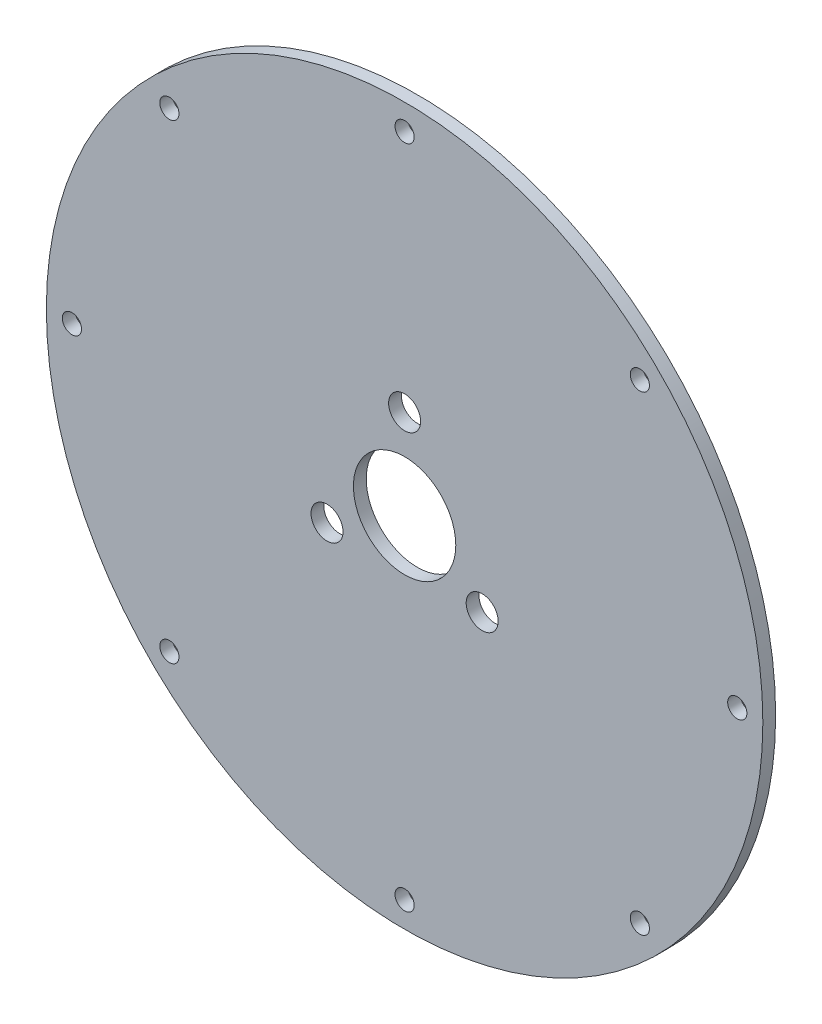
ISO-10303-21;
HEADER;
FILE_DESCRIPTION(('STEP AP214'),'2;1');
FILE_NAME('part.step','',(''),(''),'','','');
FILE_SCHEMA(('AUTOMOTIVE_DESIGN { 1 0 10303 214 1 1 1 1 }'));
ENDSEC;
DATA;
#1=APPLICATION_CONTEXT('core data for automotive mechanical design processes');
#2=APPLICATION_PROTOCOL_DEFINITION('international standard','automotive_design',2000,#1);
#3=PRODUCT_CONTEXT('',#1,'mechanical');
#4=PRODUCT('Part','Part','',(#3));
#5=PRODUCT_RELATED_PRODUCT_CATEGORY('part','',(#4));
#6=PRODUCT_DEFINITION_FORMATION('','',#4);
#7=PRODUCT_DEFINITION_CONTEXT('part definition',#1,'design');
#8=PRODUCT_DEFINITION('design','',#6,#7);
#9=PRODUCT_DEFINITION_SHAPE('','',#8);
#10=(LENGTH_UNIT() NAMED_UNIT(*) SI_UNIT(.MILLI.,.METRE.));
#11=(NAMED_UNIT(*) PLANE_ANGLE_UNIT() SI_UNIT($,.RADIAN.));
#12=(NAMED_UNIT(*) SI_UNIT($,.STERADIAN.) SOLID_ANGLE_UNIT());
#13=UNCERTAINTY_MEASURE_WITH_UNIT(LENGTH_MEASURE(1.E-05),#10,'distance_accuracy_value','');
#14=(GEOMETRIC_REPRESENTATION_CONTEXT(3) GLOBAL_UNCERTAINTY_ASSIGNED_CONTEXT((#13)) GLOBAL_UNIT_ASSIGNED_CONTEXT((#10,
#11,#12)) REPRESENTATION_CONTEXT('',''));
#15=CARTESIAN_POINT('',(0.,0.,0.));
#16=DIRECTION('',(0.,0.,1.));
#17=DIRECTION('',(1.,0.,0.));
#18=AXIS2_PLACEMENT_3D('',#15,#16,#17);
#19=CARTESIAN_POINT('',(0.,0.,3.175));
#20=DIRECTION('',(0.,0.,1.));
#21=DIRECTION('',(1.,0.,0.));
#22=AXIS2_PLACEMENT_3D('',#19,#20,#21);
#23=PLANE('',#22);
#24=CARTESIAN_POINT('',(-82.5499999999932,-6.75975422558164E-12,3.175));
#25=DIRECTION('',(0.,0.,1.));
#26=DIRECTION('',(1.,0.,0.));
#27=AXIS2_PLACEMENT_3D('',#24,#25,#26);
#28=CIRCLE('',#27,2.38125000000001);
#29=CARTESIAN_POINT('',(-80.1687499999933,-6.75975422558164E-12,3.175));
#30=VERTEX_POINT('',#29);
#31=EDGE_CURVE('E130',#30,#30,#28,.T.);
#32=ORIENTED_EDGE('',*,*,#31,.F.);
#33=EDGE_LOOP('',(#32));
#34=FACE_BOUND('',#33,.T.);
#35=CARTESIAN_POINT('',(1.34992895325094E-11,-82.55,3.175));
#36=DIRECTION('',(0.,0.,1.));
#37=DIRECTION('',(1.,0.,0.));
#38=AXIS2_PLACEMENT_3D('',#35,#36,#37);
#39=CIRCLE('',#38,2.38125);
#40=CARTESIAN_POINT('',(2.3812500000135,-82.55,3.175));
#41=VERTEX_POINT('',#40);
#42=EDGE_CURVE('E114',#41,#41,#39,.T.);
#43=ORIENTED_EDGE('',*,*,#42,.F.);
#44=EDGE_LOOP('',(#43));
#45=FACE_BOUND('',#44,.T.);
#46=CARTESIAN_POINT('',(82.5500000000067,6.74964476625468E-12,3.175));
#47=DIRECTION('',(0.,0.,1.));
#48=DIRECTION('',(1.,0.,0.));
#49=AXIS2_PLACEMENT_3D('',#46,#47,#48);
#50=CIRCLE('',#49,2.38125000000001);
#51=CARTESIAN_POINT('',(84.9312500000067,6.74964476625468E-12,3.175));
#52=VERTEX_POINT('',#51);
#53=EDGE_CURVE('E98',#52,#52,#50,.T.);
#54=ORIENTED_EDGE('',*,*,#53,.F.);
#55=EDGE_LOOP('',(#54));
#56=FACE_BOUND('',#55,.T.);
#57=CARTESIAN_POINT('',(0.,0.,3.175));
#58=DIRECTION('',(0.,0.,1.));
#59=DIRECTION('',(1.,0.,0.));
#60=AXIS2_PLACEMENT_3D('',#57,#58,#59);
#61=CIRCLE('',#60,12.7);
#62=CARTESIAN_POINT('',(12.7,0.,3.175));
#63=VERTEX_POINT('',#62);
#64=EDGE_CURVE('E82',#63,#63,#61,.T.);
#65=ORIENTED_EDGE('',*,*,#64,.F.);
#66=EDGE_LOOP('',(#65));
#67=FACE_BOUND('',#66,.T.);
#68=CARTESIAN_POINT('',(-19.2474145991092,-11.1124999999998,3.175));
#69=DIRECTION('',(0.,0.,1.));
#70=DIRECTION('',(1.,0.,0.));
#71=AXIS2_PLACEMENT_3D('',#68,#69,#70);
#72=CIRCLE('',#71,3.96875);
#73=CARTESIAN_POINT('',(-15.2786645991092,-11.1124999999998,3.175));
#74=VERTEX_POINT('',#73);
#75=EDGE_CURVE('E66',#74,#74,#72,.T.);
#76=ORIENTED_EDGE('',*,*,#75,.F.);
#77=EDGE_LOOP('',(#76));
#78=FACE_BOUND('',#77,.T.);
#79=CARTESIAN_POINT('',(0.,22.225,3.175));
#80=DIRECTION('',(0.,0.,1.));
#81=DIRECTION('',(1.,0.,0.));
#82=AXIS2_PLACEMENT_3D('',#79,#80,#81);
#83=CIRCLE('',#82,3.96875);
#84=CARTESIAN_POINT('',(3.96875,22.225,3.175));
#85=VERTEX_POINT('',#84);
#86=EDGE_CURVE('E52',#85,#85,#83,.T.);
#87=ORIENTED_EDGE('',*,*,#86,.F.);
#88=EDGE_LOOP('',(#87));
#89=FACE_BOUND('',#88,.T.);
#90=CARTESIAN_POINT('',(0.,0.,3.175));
#91=DIRECTION('',(0.,0.,1.));
#92=DIRECTION('',(1.,0.,0.));
#93=AXIS2_PLACEMENT_3D('',#90,#91,#92);
#94=CIRCLE('',#93,88.9);
#95=CARTESIAN_POINT('',(88.9,0.,3.175));
#96=VERTEX_POINT('',#95);
#97=EDGE_CURVE('E10',#96,#96,#94,.T.);
#98=ORIENTED_EDGE('',*,*,#97,.T.);
#99=EDGE_LOOP('',(#98));
#100=FACE_BOUND('',#99,.T.);
#101=CARTESIAN_POINT('',(19.2474145991091,-11.1125000000001,3.175));
#102=DIRECTION('',(0.,0.,1.));
#103=DIRECTION('',(1.,0.,0.));
#104=AXIS2_PLACEMENT_3D('',#101,#102,#103);
#105=CIRCLE('',#104,3.96875);
#106=CARTESIAN_POINT('',(23.2161645991091,-11.1125000000001,3.175));
#107=VERTEX_POINT('',#106);
#108=EDGE_CURVE('E58',#107,#107,#105,.T.);
#109=ORIENTED_EDGE('',*,*,#108,.F.);
#110=EDGE_LOOP('',(#109));
#111=FACE_BOUND('',#110,.T.);
#112=CARTESIAN_POINT('',(0.,82.55,3.175));
#113=DIRECTION('',(0.,0.,1.));
#114=DIRECTION('',(1.,0.,0.));
#115=AXIS2_PLACEMENT_3D('',#112,#113,#114);
#116=CIRCLE('',#115,2.38125);
#117=CARTESIAN_POINT('',(2.38125,82.55,3.175));
#118=VERTEX_POINT('',#117);
#119=EDGE_CURVE('E74',#118,#118,#116,.T.);
#120=ORIENTED_EDGE('',*,*,#119,.F.);
#121=EDGE_LOOP('',(#120));
#122=FACE_BOUND('',#121,.T.);
#123=CARTESIAN_POINT('',(58.3716647869515,58.3716647869543,3.175));
#124=DIRECTION('',(0.,0.,1.));
#125=DIRECTION('',(1.,0.,0.));
#126=AXIS2_PLACEMENT_3D('',#123,#124,#125);
#127=CIRCLE('',#126,2.38125);
#128=CARTESIAN_POINT('',(60.7529147869515,58.3716647869543,3.175));
#129=VERTEX_POINT('',#128);
#130=EDGE_CURVE('E90',#129,#129,#127,.T.);
#131=ORIENTED_EDGE('',*,*,#130,.F.);
#132=EDGE_LOOP('',(#131));
#133=FACE_BOUND('',#132,.T.);
#134=CARTESIAN_POINT('',(58.371664786961,-58.3716647869447,3.175));
#135=DIRECTION('',(0.,0.,1.));
#136=DIRECTION('',(1.,0.,0.));
#137=AXIS2_PLACEMENT_3D('',#134,#135,#136);
#138=CIRCLE('',#137,2.38125);
#139=CARTESIAN_POINT('',(60.752914786961,-58.3716647869447,3.175));
#140=VERTEX_POINT('',#139);
#141=EDGE_CURVE('E106',#140,#140,#138,.T.);
#142=ORIENTED_EDGE('',*,*,#141,.F.);
#143=EDGE_LOOP('',(#142));
#144=FACE_BOUND('',#143,.T.);
#145=CARTESIAN_POINT('',(-58.371664786938,-58.3716647869543,3.175));
#146=DIRECTION('',(0.,0.,1.));
#147=DIRECTION('',(1.,0.,0.));
#148=AXIS2_PLACEMENT_3D('',#145,#146,#147);
#149=CIRCLE('',#148,2.38125);
#150=CARTESIAN_POINT('',(-55.990414786938,-58.3716647869543,3.175));
#151=VERTEX_POINT('',#150);
#152=EDGE_CURVE('E122',#151,#151,#149,.T.);
#153=ORIENTED_EDGE('',*,*,#152,.F.);
#154=EDGE_LOOP('',(#153));
#155=FACE_BOUND('',#154,.T.);
#156=CARTESIAN_POINT('',(-58.3716647869475,58.3716647869447,3.175));
#157=DIRECTION('',(0.,0.,1.));
#158=DIRECTION('',(1.,0.,0.));
#159=AXIS2_PLACEMENT_3D('',#156,#157,#158);
#160=CIRCLE('',#159,2.38125);
#161=CARTESIAN_POINT('',(-55.9904147869475,58.3716647869447,3.175));
#162=VERTEX_POINT('',#161);
#163=EDGE_CURVE('E138',#162,#162,#160,.T.);
#164=ORIENTED_EDGE('',*,*,#163,.F.);
#165=EDGE_LOOP('',(#164));
#166=FACE_BOUND('',#165,.T.);
#167=ADVANCED_FACE('F39',(#34,#45,#56,#67,#78,#89,#100,#111,#122,#133,#144,#155,#166),#23,.T.);
#168=CARTESIAN_POINT('',(0.,0.,0.));
#169=DIRECTION('',(0.,0.,1.));
#170=DIRECTION('',(1.,0.,0.));
#171=AXIS2_PLACEMENT_3D('',#168,#169,#170);
#172=PLANE('',#171);
#173=CARTESIAN_POINT('',(0.,0.,0.));
#174=DIRECTION('',(0.,0.,1.));
#175=DIRECTION('',(1.,0.,0.));
#176=AXIS2_PLACEMENT_3D('',#173,#174,#175);
#177=CIRCLE('',#176,88.9);
#178=CARTESIAN_POINT('',(88.9,0.,0.));
#179=VERTEX_POINT('',#178);
#180=EDGE_CURVE('E43',#179,#179,#177,.T.);
#181=ORIENTED_EDGE('',*,*,#180,.F.);
#182=EDGE_LOOP('',(#181));
#183=FACE_BOUND('',#182,.T.);
#184=CARTESIAN_POINT('',(0.,22.225,0.));
#185=DIRECTION('',(0.,0.,1.));
#186=DIRECTION('',(1.,0.,0.));
#187=AXIS2_PLACEMENT_3D('',#184,#185,#186);
#188=CIRCLE('',#187,3.96875);
#189=CARTESIAN_POINT('',(3.96875,22.225,0.));
#190=VERTEX_POINT('',#189);
#191=EDGE_CURVE('E54',#190,#190,#188,.T.);
#192=ORIENTED_EDGE('',*,*,#191,.T.);
#193=EDGE_LOOP('',(#192));
#194=FACE_BOUND('',#193,.T.);
#195=CARTESIAN_POINT('',(19.2474145991091,-11.1125000000001,0.));
#196=DIRECTION('',(0.,0.,1.));
#197=DIRECTION('',(1.,0.,0.));
#198=AXIS2_PLACEMENT_3D('',#195,#196,#197);
#199=CIRCLE('',#198,3.96875);
#200=CARTESIAN_POINT('',(23.2161645991091,-11.1125000000001,0.));
#201=VERTEX_POINT('',#200);
#202=EDGE_CURVE('E62',#201,#201,#199,.T.);
#203=ORIENTED_EDGE('',*,*,#202,.T.);
#204=EDGE_LOOP('',(#203));
#205=FACE_BOUND('',#204,.T.);
#206=CARTESIAN_POINT('',(-19.2474145991092,-11.1124999999998,0.));
#207=DIRECTION('',(0.,0.,1.));
#208=DIRECTION('',(1.,0.,0.));
#209=AXIS2_PLACEMENT_3D('',#206,#207,#208);
#210=CIRCLE('',#209,3.96875);
#211=CARTESIAN_POINT('',(-15.2786645991092,-11.1124999999998,0.));
#212=VERTEX_POINT('',#211);
#213=EDGE_CURVE('E70',#212,#212,#210,.T.);
#214=ORIENTED_EDGE('',*,*,#213,.T.);
#215=EDGE_LOOP('',(#214));
#216=FACE_BOUND('',#215,.T.);
#217=CARTESIAN_POINT('',(0.,82.55,0.));
#218=DIRECTION('',(0.,0.,1.));
#219=DIRECTION('',(1.,0.,0.));
#220=AXIS2_PLACEMENT_3D('',#217,#218,#219);
#221=CIRCLE('',#220,2.38125);
#222=CARTESIAN_POINT('',(2.38125,82.55,0.));
#223=VERTEX_POINT('',#222);
#224=EDGE_CURVE('E78',#223,#223,#221,.T.);
#225=ORIENTED_EDGE('',*,*,#224,.T.);
#226=EDGE_LOOP('',(#225));
#227=FACE_BOUND('',#226,.T.);
#228=CARTESIAN_POINT('',(0.,0.,0.));
#229=DIRECTION('',(0.,0.,1.));
#230=DIRECTION('',(1.,0.,0.));
#231=AXIS2_PLACEMENT_3D('',#228,#229,#230);
#232=CIRCLE('',#231,12.7);
#233=CARTESIAN_POINT('',(12.7,0.,0.));
#234=VERTEX_POINT('',#233);
#235=EDGE_CURVE('E86',#234,#234,#232,.T.);
#236=ORIENTED_EDGE('',*,*,#235,.T.);
#237=EDGE_LOOP('',(#236));
#238=FACE_BOUND('',#237,.T.);
#239=CARTESIAN_POINT('',(58.3716647869515,58.3716647869543,0.));
#240=DIRECTION('',(0.,0.,1.));
#241=DIRECTION('',(1.,0.,0.));
#242=AXIS2_PLACEMENT_3D('',#239,#240,#241);
#243=CIRCLE('',#242,2.38125);
#244=CARTESIAN_POINT('',(60.7529147869515,58.3716647869543,0.));
#245=VERTEX_POINT('',#244);
#246=EDGE_CURVE('E94',#245,#245,#243,.T.);
#247=ORIENTED_EDGE('',*,*,#246,.T.);
#248=EDGE_LOOP('',(#247));
#249=FACE_BOUND('',#248,.T.);
#250=CARTESIAN_POINT('',(82.5500000000067,6.74964476625468E-12,0.));
#251=DIRECTION('',(0.,0.,1.));
#252=DIRECTION('',(1.,0.,0.));
#253=AXIS2_PLACEMENT_3D('',#250,#251,#252);
#254=CIRCLE('',#253,2.38125000000001);
#255=CARTESIAN_POINT('',(84.9312500000067,6.74964476625468E-12,0.));
#256=VERTEX_POINT('',#255);
#257=EDGE_CURVE('E102',#256,#256,#254,.T.);
#258=ORIENTED_EDGE('',*,*,#257,.T.);
#259=EDGE_LOOP('',(#258));
#260=FACE_BOUND('',#259,.T.);
#261=CARTESIAN_POINT('',(58.371664786961,-58.3716647869447,0.));
#262=DIRECTION('',(0.,0.,1.));
#263=DIRECTION('',(1.,0.,0.));
#264=AXIS2_PLACEMENT_3D('',#261,#262,#263);
#265=CIRCLE('',#264,2.38125);
#266=CARTESIAN_POINT('',(60.752914786961,-58.3716647869447,0.));
#267=VERTEX_POINT('',#266);
#268=EDGE_CURVE('E110',#267,#267,#265,.T.);
#269=ORIENTED_EDGE('',*,*,#268,.T.);
#270=EDGE_LOOP('',(#269));
#271=FACE_BOUND('',#270,.T.);
#272=CARTESIAN_POINT('',(1.34992895325094E-11,-82.55,0.));
#273=DIRECTION('',(0.,0.,1.));
#274=DIRECTION('',(1.,0.,0.));
#275=AXIS2_PLACEMENT_3D('',#272,#273,#274);
#276=CIRCLE('',#275,2.38125);
#277=CARTESIAN_POINT('',(2.3812500000135,-82.55,0.));
#278=VERTEX_POINT('',#277);
#279=EDGE_CURVE('E118',#278,#278,#276,.T.);
#280=ORIENTED_EDGE('',*,*,#279,.T.);
#281=EDGE_LOOP('',(#280));
#282=FACE_BOUND('',#281,.T.);
#283=CARTESIAN_POINT('',(-58.371664786938,-58.3716647869543,0.));
#284=DIRECTION('',(0.,0.,1.));
#285=DIRECTION('',(1.,0.,0.));
#286=AXIS2_PLACEMENT_3D('',#283,#284,#285);
#287=CIRCLE('',#286,2.38125);
#288=CARTESIAN_POINT('',(-55.990414786938,-58.3716647869543,0.));
#289=VERTEX_POINT('',#288);
#290=EDGE_CURVE('E126',#289,#289,#287,.T.);
#291=ORIENTED_EDGE('',*,*,#290,.T.);
#292=EDGE_LOOP('',(#291));
#293=FACE_BOUND('',#292,.T.);
#294=CARTESIAN_POINT('',(-82.5499999999932,-6.75975422558164E-12,0.));
#295=DIRECTION('',(0.,0.,1.));
#296=DIRECTION('',(1.,0.,0.));
#297=AXIS2_PLACEMENT_3D('',#294,#295,#296);
#298=CIRCLE('',#297,2.38125000000001);
#299=CARTESIAN_POINT('',(-80.1687499999933,-6.75975422558164E-12,0.));
#300=VERTEX_POINT('',#299);
#301=EDGE_CURVE('E134',#300,#300,#298,.T.);
#302=ORIENTED_EDGE('',*,*,#301,.T.);
#303=EDGE_LOOP('',(#302));
#304=FACE_BOUND('',#303,.T.);
#305=CARTESIAN_POINT('',(-58.3716647869475,58.3716647869447,0.));
#306=DIRECTION('',(0.,0.,1.));
#307=DIRECTION('',(1.,0.,0.));
#308=AXIS2_PLACEMENT_3D('',#305,#306,#307);
#309=CIRCLE('',#308,2.38125);
#310=CARTESIAN_POINT('',(-55.9904147869475,58.3716647869447,0.));
#311=VERTEX_POINT('',#310);
#312=EDGE_CURVE('E142',#311,#311,#309,.T.);
#313=ORIENTED_EDGE('',*,*,#312,.T.);
#314=EDGE_LOOP('',(#313));
#315=FACE_BOUND('',#314,.T.);
#316=ADVANCED_FACE('F154',(#183,#194,#205,#216,#227,#238,#249,#260,#271,#282,#293,#304,#315),
#172,.F.);
#317=CARTESIAN_POINT('',(0.,0.,3.175));
#318=DIRECTION('',(0.,0.,-1.));
#319=DIRECTION('',(-1.,0.,0.));
#320=AXIS2_PLACEMENT_3D('',#317,#318,#319);
#321=CYLINDRICAL_SURFACE('',#320,88.9);
#322=ORIENTED_EDGE('',*,*,#97,.F.);
#323=EDGE_LOOP('',(#322));
#324=FACE_BOUND('',#323,.T.);
#325=ORIENTED_EDGE('',*,*,#180,.T.);
#326=EDGE_LOOP('',(#325));
#327=FACE_BOUND('',#326,.T.);
#328=ADVANCED_FACE('F41',(#324,#327),#321,.T.);
#329=CARTESIAN_POINT('',(0.,22.225,3.175));
#330=DIRECTION('',(0.,0.,-1.));
#331=DIRECTION('',(-1.,0.,0.));
#332=AXIS2_PLACEMENT_3D('',#329,#330,#331);
#333=CYLINDRICAL_SURFACE('',#332,3.96875);
#334=ORIENTED_EDGE('',*,*,#86,.T.);
#335=EDGE_LOOP('',(#334));
#336=FACE_BOUND('',#335,.T.);
#337=ORIENTED_EDGE('',*,*,#191,.F.);
#338=EDGE_LOOP('',(#337));
#339=FACE_BOUND('',#338,.T.);
#340=ADVANCED_FACE('F164',(#336,#339),#333,.F.);
#341=CARTESIAN_POINT('',(19.2474145991091,-11.1125000000001,3.175));
#342=DIRECTION('',(0.,0.,-1.));
#343=DIRECTION('',(-1.,0.,0.));
#344=AXIS2_PLACEMENT_3D('',#341,#342,#343);
#345=CYLINDRICAL_SURFACE('',#344,3.96875);
#346=ORIENTED_EDGE('',*,*,#108,.T.);
#347=EDGE_LOOP('',(#346));
#348=FACE_BOUND('',#347,.T.);
#349=ORIENTED_EDGE('',*,*,#202,.F.);
#350=EDGE_LOOP('',(#349));
#351=FACE_BOUND('',#350,.T.);
#352=ADVANCED_FACE('F167',(#348,#351),#345,.F.);
#353=CARTESIAN_POINT('',(-19.2474145991092,-11.1124999999998,3.175));
#354=DIRECTION('',(0.,0.,-1.));
#355=DIRECTION('',(-1.,0.,0.));
#356=AXIS2_PLACEMENT_3D('',#353,#354,#355);
#357=CYLINDRICAL_SURFACE('',#356,3.96875);
#358=ORIENTED_EDGE('',*,*,#75,.T.);
#359=EDGE_LOOP('',(#358));
#360=FACE_BOUND('',#359,.T.);
#361=ORIENTED_EDGE('',*,*,#213,.F.);
#362=EDGE_LOOP('',(#361));
#363=FACE_BOUND('',#362,.T.);
#364=ADVANCED_FACE('F171',(#360,#363),#357,.F.);
#365=CARTESIAN_POINT('',(0.,82.55,3.175));
#366=DIRECTION('',(0.,0.,-1.));
#367=DIRECTION('',(-1.,0.,0.));
#368=AXIS2_PLACEMENT_3D('',#365,#366,#367);
#369=CYLINDRICAL_SURFACE('',#368,2.38125);
#370=ORIENTED_EDGE('',*,*,#119,.T.);
#371=EDGE_LOOP('',(#370));
#372=FACE_BOUND('',#371,.T.);
#373=ORIENTED_EDGE('',*,*,#224,.F.);
#374=EDGE_LOOP('',(#373));
#375=FACE_BOUND('',#374,.T.);
#376=ADVANCED_FACE('F175',(#372,#375),#369,.F.);
#377=CARTESIAN_POINT('',(0.,0.,3.175));
#378=DIRECTION('',(0.,0.,-1.));
#379=DIRECTION('',(-1.,0.,0.));
#380=AXIS2_PLACEMENT_3D('',#377,#378,#379);
#381=CYLINDRICAL_SURFACE('',#380,12.7);
#382=ORIENTED_EDGE('',*,*,#64,.T.);
#383=EDGE_LOOP('',(#382));
#384=FACE_BOUND('',#383,.T.);
#385=ORIENTED_EDGE('',*,*,#235,.F.);
#386=EDGE_LOOP('',(#385));
#387=FACE_BOUND('',#386,.T.);
#388=ADVANCED_FACE('F179',(#384,#387),#381,.F.);
#389=CARTESIAN_POINT('',(58.3716647869515,58.3716647869543,3.175));
#390=DIRECTION('',(0.,0.,-1.));
#391=DIRECTION('',(-1.,0.,0.));
#392=AXIS2_PLACEMENT_3D('',#389,#390,#391);
#393=CYLINDRICAL_SURFACE('',#392,2.38125);
#394=ORIENTED_EDGE('',*,*,#130,.T.);
#395=EDGE_LOOP('',(#394));
#396=FACE_BOUND('',#395,.T.);
#397=ORIENTED_EDGE('',*,*,#246,.F.);
#398=EDGE_LOOP('',(#397));
#399=FACE_BOUND('',#398,.T.);
#400=ADVANCED_FACE('F183',(#396,#399),#393,.F.);
#401=CARTESIAN_POINT('',(82.5500000000067,6.74964476625468E-12,3.175));
#402=DIRECTION('',(0.,0.,-1.));
#403=DIRECTION('',(-1.,0.,0.));
#404=AXIS2_PLACEMENT_3D('',#401,#402,#403);
#405=CYLINDRICAL_SURFACE('',#404,2.38125000000001);
#406=ORIENTED_EDGE('',*,*,#53,.T.);
#407=EDGE_LOOP('',(#406));
#408=FACE_BOUND('',#407,.T.);
#409=ORIENTED_EDGE('',*,*,#257,.F.);
#410=EDGE_LOOP('',(#409));
#411=FACE_BOUND('',#410,.T.);
#412=ADVANCED_FACE('F187',(#408,#411),#405,.F.);
#413=CARTESIAN_POINT('',(58.371664786961,-58.3716647869447,3.175));
#414=DIRECTION('',(0.,0.,-1.));
#415=DIRECTION('',(-1.,0.,0.));
#416=AXIS2_PLACEMENT_3D('',#413,#414,#415);
#417=CYLINDRICAL_SURFACE('',#416,2.38125);
#418=ORIENTED_EDGE('',*,*,#141,.T.);
#419=EDGE_LOOP('',(#418));
#420=FACE_BOUND('',#419,.T.);
#421=ORIENTED_EDGE('',*,*,#268,.F.);
#422=EDGE_LOOP('',(#421));
#423=FACE_BOUND('',#422,.T.);
#424=ADVANCED_FACE('F191',(#420,#423),#417,.F.);
#425=CARTESIAN_POINT('',(1.34992895325094E-11,-82.55,3.175));
#426=DIRECTION('',(0.,0.,-1.));
#427=DIRECTION('',(-1.,0.,0.));
#428=AXIS2_PLACEMENT_3D('',#425,#426,#427);
#429=CYLINDRICAL_SURFACE('',#428,2.38125);
#430=ORIENTED_EDGE('',*,*,#42,.T.);
#431=EDGE_LOOP('',(#430));
#432=FACE_BOUND('',#431,.T.);
#433=ORIENTED_EDGE('',*,*,#279,.F.);
#434=EDGE_LOOP('',(#433));
#435=FACE_BOUND('',#434,.T.);
#436=ADVANCED_FACE('F195',(#432,#435),#429,.F.);
#437=CARTESIAN_POINT('',(-58.371664786938,-58.3716647869543,3.175));
#438=DIRECTION('',(0.,0.,-1.));
#439=DIRECTION('',(-1.,0.,0.));
#440=AXIS2_PLACEMENT_3D('',#437,#438,#439);
#441=CYLINDRICAL_SURFACE('',#440,2.38125);
#442=ORIENTED_EDGE('',*,*,#152,.T.);
#443=EDGE_LOOP('',(#442));
#444=FACE_BOUND('',#443,.T.);
#445=ORIENTED_EDGE('',*,*,#290,.F.);
#446=EDGE_LOOP('',(#445));
#447=FACE_BOUND('',#446,.T.);
#448=ADVANCED_FACE('F199',(#444,#447),#441,.F.);
#449=CARTESIAN_POINT('',(-82.5499999999932,-6.75975422558164E-12,3.175));
#450=DIRECTION('',(0.,0.,-1.));
#451=DIRECTION('',(-1.,0.,0.));
#452=AXIS2_PLACEMENT_3D('',#449,#450,#451);
#453=CYLINDRICAL_SURFACE('',#452,2.38125000000001);
#454=ORIENTED_EDGE('',*,*,#31,.T.);
#455=EDGE_LOOP('',(#454));
#456=FACE_BOUND('',#455,.T.);
#457=ORIENTED_EDGE('',*,*,#301,.F.);
#458=EDGE_LOOP('',(#457));
#459=FACE_BOUND('',#458,.T.);
#460=ADVANCED_FACE('F203',(#456,#459),#453,.F.);
#461=CARTESIAN_POINT('',(-58.3716647869475,58.3716647869447,3.175));
#462=DIRECTION('',(0.,0.,-1.));
#463=DIRECTION('',(-1.,0.,0.));
#464=AXIS2_PLACEMENT_3D('',#461,#462,#463);
#465=CYLINDRICAL_SURFACE('',#464,2.38125);
#466=ORIENTED_EDGE('',*,*,#163,.T.);
#467=EDGE_LOOP('',(#466));
#468=FACE_BOUND('',#467,.T.);
#469=ORIENTED_EDGE('',*,*,#312,.F.);
#470=EDGE_LOOP('',(#469));
#471=FACE_BOUND('',#470,.T.);
#472=ADVANCED_FACE('F150',(#468,#471),#465,.F.);
#473=CLOSED_SHELL('',(#167,#316,#328,#340,#352,#364,#376,#388,#400,#412,#424,#436,#448,#460,#472));
#474=MANIFOLD_SOLID_BREP('B2',#473);
#475=ADVANCED_BREP_SHAPE_REPRESENTATION('',(#18,#474),#14);
#476=SHAPE_DEFINITION_REPRESENTATION(#9,#475);
ENDSEC;
END-ISO-10303-21;
